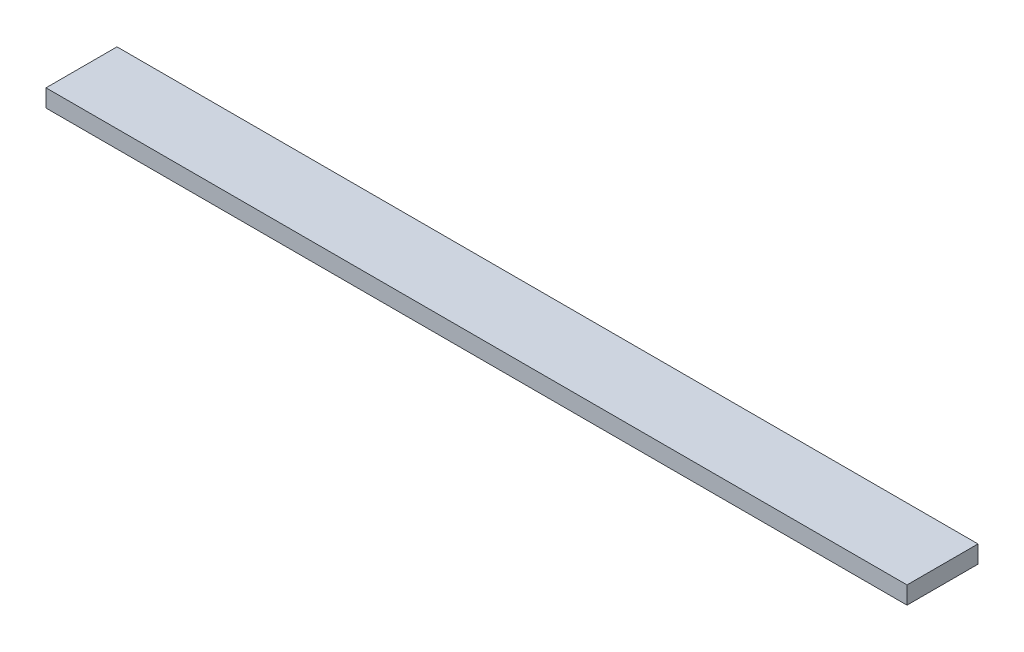
ISO-10303-21;
HEADER;
FILE_DESCRIPTION(('STEP AP214'),'2;1');
FILE_NAME('part.step','',(''),(''),'','','');
FILE_SCHEMA(('AUTOMOTIVE_DESIGN { 1 0 10303 214 1 1 1 1 }'));
ENDSEC;
DATA;
#1=APPLICATION_CONTEXT('core data for automotive mechanical design processes');
#2=APPLICATION_PROTOCOL_DEFINITION('international standard','automotive_design',2000,#1);
#3=PRODUCT_CONTEXT('',#1,'mechanical');
#4=PRODUCT('Part','Part','',(#3));
#5=PRODUCT_RELATED_PRODUCT_CATEGORY('part','',(#4));
#6=PRODUCT_DEFINITION_FORMATION('','',#4);
#7=PRODUCT_DEFINITION_CONTEXT('part definition',#1,'design');
#8=PRODUCT_DEFINITION('design','',#6,#7);
#9=PRODUCT_DEFINITION_SHAPE('','',#8);
#10=(LENGTH_UNIT() NAMED_UNIT(*) SI_UNIT(.MILLI.,.METRE.));
#11=(NAMED_UNIT(*) PLANE_ANGLE_UNIT() SI_UNIT($,.RADIAN.));
#12=(NAMED_UNIT(*) SI_UNIT($,.STERADIAN.) SOLID_ANGLE_UNIT());
#13=UNCERTAINTY_MEASURE_WITH_UNIT(LENGTH_MEASURE(1.E-05),#10,'distance_accuracy_value','');
#14=(GEOMETRIC_REPRESENTATION_CONTEXT(3) GLOBAL_UNCERTAINTY_ASSIGNED_CONTEXT((#13)) GLOBAL_UNIT_ASSIGNED_CONTEXT((#10,
#11,#12)) REPRESENTATION_CONTEXT('',''));
#15=CARTESIAN_POINT('',(0.,0.,0.));
#16=DIRECTION('',(0.,0.,1.));
#17=DIRECTION('',(1.,0.,0.));
#18=AXIS2_PLACEMENT_3D('',#15,#16,#17);
#19=CARTESIAN_POINT('',(155.5,6.34,-12.82));
#20=DIRECTION('',(-1.,0.,0.));
#21=DIRECTION('',(0.,0.,1.));
#22=AXIS2_PLACEMENT_3D('',#19,#20,#21);
#23=PLANE('',#22);
#24=DIRECTION('',(0.,0.,-1.));
#25=VECTOR('',#24,1.);
#26=CARTESIAN_POINT('',(155.5,0.,-12.82));
#27=LINE('',#26,#25);
#28=CARTESIAN_POINT('',(155.5,0.,12.82));
#29=VERTEX_POINT('',#28);
#30=CARTESIAN_POINT('',(155.5,0.,-12.82));
#31=VERTEX_POINT('',#30);
#32=EDGE_CURVE('E99',#29,#31,#27,.T.);
#33=ORIENTED_EDGE('',*,*,#32,.T.);
#34=DIRECTION('',(0.,-1.,0.));
#35=VECTOR('',#34,1.);
#36=CARTESIAN_POINT('',(155.5,6.34,-12.82));
#37=LINE('',#36,#35);
#38=CARTESIAN_POINT('',(155.5,6.34,-12.82));
#39=VERTEX_POINT('',#38);
#40=EDGE_CURVE('E11',#39,#31,#37,.T.);
#41=ORIENTED_EDGE('',*,*,#40,.F.);
#42=DIRECTION('',(0.,0.,-1.));
#43=VECTOR('',#42,1.);
#44=CARTESIAN_POINT('',(155.5,6.34,-12.82));
#45=LINE('',#44,#43);
#46=CARTESIAN_POINT('',(155.5,6.34,12.82));
#47=VERTEX_POINT('',#46);
#48=EDGE_CURVE('E87',#47,#39,#45,.T.);
#49=ORIENTED_EDGE('',*,*,#48,.F.);
#50=DIRECTION('',(0.,-1.,0.));
#51=VECTOR('',#50,1.);
#52=CARTESIAN_POINT('',(155.5,6.34,12.82));
#53=LINE('',#52,#51);
#54=EDGE_CURVE('E95',#47,#29,#53,.T.);
#55=ORIENTED_EDGE('',*,*,#54,.T.);
#56=EDGE_LOOP('',(#33,#41,#49,#55));
#57=FACE_BOUND('',#56,.T.);
#58=ADVANCED_FACE('F36',(#57),#23,.F.);
#59=CARTESIAN_POINT('',(-155.5,6.34,-12.82));
#60=DIRECTION('',(0.,0.,1.));
#61=DIRECTION('',(1.,0.,0.));
#62=AXIS2_PLACEMENT_3D('',#59,#60,#61);
#63=PLANE('',#62);
#64=DIRECTION('',(-1.,0.,0.));
#65=VECTOR('',#64,1.);
#66=CARTESIAN_POINT('',(-155.5,0.,-12.82));
#67=LINE('',#66,#65);
#68=CARTESIAN_POINT('',(-155.5,0.,-12.82));
#69=VERTEX_POINT('',#68);
#70=EDGE_CURVE('E91',#31,#69,#67,.T.);
#71=ORIENTED_EDGE('',*,*,#70,.T.);
#72=DIRECTION('',(0.,-1.,0.));
#73=VECTOR('',#72,1.);
#74=CARTESIAN_POINT('',(-155.5,6.34,-12.82));
#75=LINE('',#74,#73);
#76=CARTESIAN_POINT('',(-155.5,6.34,-12.82));
#77=VERTEX_POINT('',#76);
#78=EDGE_CURVE('E44',#77,#69,#75,.T.);
#79=ORIENTED_EDGE('',*,*,#78,.F.);
#80=DIRECTION('',(-1.,0.,0.));
#81=VECTOR('',#80,1.);
#82=CARTESIAN_POINT('',(-155.5,6.34,-12.82));
#83=LINE('',#82,#81);
#84=EDGE_CURVE('E82',#39,#77,#83,.T.);
#85=ORIENTED_EDGE('',*,*,#84,.F.);
#86=ORIENTED_EDGE('',*,*,#40,.T.);
#87=EDGE_LOOP('',(#71,#79,#85,#86));
#88=FACE_BOUND('',#87,.T.);
#89=ADVANCED_FACE('F90',(#88),#63,.F.);
#90=CARTESIAN_POINT('',(-155.5,6.34,-12.82));
#91=DIRECTION('',(1.,0.,0.));
#92=DIRECTION('',(0.,0.,-1.));
#93=AXIS2_PLACEMENT_3D('',#90,#91,#92);
#94=PLANE('',#93);
#95=DIRECTION('',(0.,0.,1.));
#96=VECTOR('',#95,1.);
#97=CARTESIAN_POINT('',(-155.5,0.,-12.82));
#98=LINE('',#97,#96);
#99=CARTESIAN_POINT('',(-155.5,0.,12.82));
#100=VERTEX_POINT('',#99);
#101=EDGE_CURVE('E69',#69,#100,#98,.T.);
#102=ORIENTED_EDGE('',*,*,#101,.T.);
#103=DIRECTION('',(0.,-1.,0.));
#104=VECTOR('',#103,1.);
#105=CARTESIAN_POINT('',(-155.5,6.34,12.82));
#106=LINE('',#105,#104);
#107=CARTESIAN_POINT('',(-155.5,6.34,12.82));
#108=VERTEX_POINT('',#107);
#109=EDGE_CURVE('E92',#108,#100,#106,.T.);
#110=ORIENTED_EDGE('',*,*,#109,.F.);
#111=DIRECTION('',(0.,0.,1.));
#112=VECTOR('',#111,1.);
#113=CARTESIAN_POINT('',(-155.5,6.34,-12.82));
#114=LINE('',#113,#112);
#115=EDGE_CURVE('E85',#77,#108,#114,.T.);
#116=ORIENTED_EDGE('',*,*,#115,.F.);
#117=ORIENTED_EDGE('',*,*,#78,.T.);
#118=EDGE_LOOP('',(#102,#110,#116,#117));
#119=FACE_BOUND('',#118,.T.);
#120=ADVANCED_FACE('F93',(#119),#94,.F.);
#121=CARTESIAN_POINT('',(-155.5,6.34,12.82));
#122=DIRECTION('',(0.,0.,-1.));
#123=DIRECTION('',(-1.,0.,0.));
#124=AXIS2_PLACEMENT_3D('',#121,#122,#123);
#125=PLANE('',#124);
#126=DIRECTION('',(1.,0.,0.));
#127=VECTOR('',#126,1.);
#128=CARTESIAN_POINT('',(-155.5,0.,12.82));
#129=LINE('',#128,#127);
#130=EDGE_CURVE('E75',#100,#29,#129,.T.);
#131=ORIENTED_EDGE('',*,*,#130,.T.);
#132=ORIENTED_EDGE('',*,*,#54,.F.);
#133=DIRECTION('',(1.,0.,0.));
#134=VECTOR('',#133,1.);
#135=CARTESIAN_POINT('',(-155.5,6.34,12.82));
#136=LINE('',#135,#134);
#137=EDGE_CURVE('E52',#108,#47,#136,.T.);
#138=ORIENTED_EDGE('',*,*,#137,.F.);
#139=ORIENTED_EDGE('',*,*,#109,.T.);
#140=EDGE_LOOP('',(#131,#132,#138,#139));
#141=FACE_BOUND('',#140,.T.);
#142=ADVANCED_FACE('F106',(#141),#125,.F.);
#143=CARTESIAN_POINT('',(0.,6.34,0.));
#144=DIRECTION('',(0.,1.,0.));
#145=DIRECTION('',(0.,0.,1.));
#146=AXIS2_PLACEMENT_3D('',#143,#144,#145);
#147=PLANE('',#146);
#148=ORIENTED_EDGE('',*,*,#48,.T.);
#149=ORIENTED_EDGE('',*,*,#84,.T.);
#150=ORIENTED_EDGE('',*,*,#115,.T.);
#151=ORIENTED_EDGE('',*,*,#137,.T.);
#152=EDGE_LOOP('',(#148,#149,#150,#151));
#153=FACE_BOUND('',#152,.T.);
#154=ADVANCED_FACE('F83',(#153),#147,.T.);
#155=CARTESIAN_POINT('',(0.,0.,0.));
#156=DIRECTION('',(0.,1.,0.));
#157=DIRECTION('',(0.,0.,1.));
#158=AXIS2_PLACEMENT_3D('',#155,#156,#157);
#159=PLANE('',#158);
#160=ORIENTED_EDGE('',*,*,#32,.F.);
#161=ORIENTED_EDGE('',*,*,#130,.F.);
#162=ORIENTED_EDGE('',*,*,#101,.F.);
#163=ORIENTED_EDGE('',*,*,#70,.F.);
#164=EDGE_LOOP('',(#160,#161,#162,#163));
#165=FACE_BOUND('',#164,.T.);
#166=ADVANCED_FACE('F109',(#165),#159,.F.);
#167=CLOSED_SHELL('',(#58,#89,#120,#142,#154,#166));
#168=MANIFOLD_SOLID_BREP('B2',#167);
#169=ADVANCED_BREP_SHAPE_REPRESENTATION('',(#18,#168),#14);
#170=SHAPE_DEFINITION_REPRESENTATION(#9,#169);
ENDSEC;
END-ISO-10303-21;
